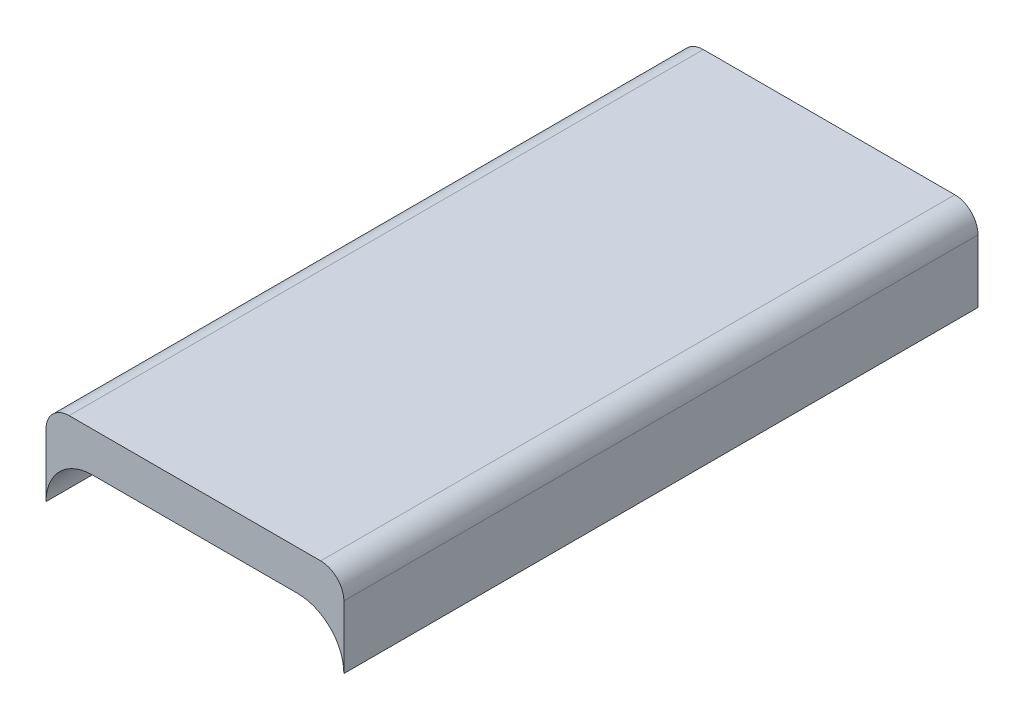
ISO-10303-21;
HEADER;
FILE_DESCRIPTION(('STEP AP214'),'2;1');
FILE_NAME('part.step','',(''),(''),'','','');
FILE_SCHEMA(('AUTOMOTIVE_DESIGN { 1 0 10303 214 1 1 1 1 }'));
ENDSEC;
DATA;
#1=APPLICATION_CONTEXT('core data for automotive mechanical design processes');
#2=APPLICATION_PROTOCOL_DEFINITION('international standard','automotive_design',2000,#1);
#3=PRODUCT_CONTEXT('',#1,'mechanical');
#4=PRODUCT('Part','Part','',(#3));
#5=PRODUCT_RELATED_PRODUCT_CATEGORY('part','',(#4));
#6=PRODUCT_DEFINITION_FORMATION('','',#4);
#7=PRODUCT_DEFINITION_CONTEXT('part definition',#1,'design');
#8=PRODUCT_DEFINITION('design','',#6,#7);
#9=PRODUCT_DEFINITION_SHAPE('','',#8);
#10=(LENGTH_UNIT() NAMED_UNIT(*) SI_UNIT(.MILLI.,.METRE.));
#11=(NAMED_UNIT(*) PLANE_ANGLE_UNIT() SI_UNIT($,.RADIAN.));
#12=(NAMED_UNIT(*) SI_UNIT($,.STERADIAN.) SOLID_ANGLE_UNIT());
#13=UNCERTAINTY_MEASURE_WITH_UNIT(LENGTH_MEASURE(1.E-05),#10,'distance_accuracy_value','');
#14=(GEOMETRIC_REPRESENTATION_CONTEXT(3) GLOBAL_UNCERTAINTY_ASSIGNED_CONTEXT((#13)) GLOBAL_UNIT_ASSIGNED_CONTEXT((#10,
#11,#12)) REPRESENTATION_CONTEXT('',''));
#15=CARTESIAN_POINT('',(0.,0.,0.));
#16=DIRECTION('',(0.,0.,1.));
#17=DIRECTION('',(1.,0.,0.));
#18=AXIS2_PLACEMENT_3D('',#15,#16,#17);
#19=CARTESIAN_POINT('',(-22.5,13.,-47.9));
#20=DIRECTION('',(1.,0.,0.));
#21=DIRECTION('',(0.,0.,-1.));
#22=AXIS2_PLACEMENT_3D('',#19,#20,#21);
#23=PLANE('',#22);
#24=DIRECTION('',(0.,-1.,0.));
#25=VECTOR('',#24,1.);
#26=CARTESIAN_POINT('',(-22.5,13.,47.9));
#27=LINE('',#26,#25);
#28=CARTESIAN_POINT('',(-22.5,9.5,47.9));
#29=VERTEX_POINT('',#28);
#30=CARTESIAN_POINT('',(-22.5,0.,47.9));
#31=VERTEX_POINT('',#30);
#32=EDGE_CURVE('E166',#29,#31,#27,.T.);
#33=ORIENTED_EDGE('',*,*,#32,.F.);
#34=DIRECTION('',(0.,0.,1.));
#35=VECTOR('',#34,1.);
#36=CARTESIAN_POINT('',(-22.5,9.5,-47.9));
#37=LINE('',#36,#35);
#38=CARTESIAN_POINT('',(-22.5,9.5,-47.9));
#39=VERTEX_POINT('',#38);
#40=EDGE_CURVE('E63',#29,#39,#37,.F.);
#41=ORIENTED_EDGE('',*,*,#40,.T.);
#42=DIRECTION('',(0.,-1.,0.));
#43=VECTOR('',#42,1.);
#44=CARTESIAN_POINT('',(-22.5,13.,-47.9));
#45=LINE('',#44,#43);
#46=CARTESIAN_POINT('',(-22.5,0.,-47.9));
#47=VERTEX_POINT('',#46);
#48=EDGE_CURVE('E103',#39,#47,#45,.T.);
#49=ORIENTED_EDGE('',*,*,#48,.T.);
#50=DIRECTION('',(0.,0.,1.));
#51=VECTOR('',#50,1.);
#52=CARTESIAN_POINT('',(-22.5,0.,-47.9));
#53=LINE('',#52,#51);
#54=EDGE_CURVE('E105',#47,#31,#53,.T.);
#55=ORIENTED_EDGE('',*,*,#54,.T.);
#56=EDGE_LOOP('',(#33,#41,#49,#55));
#57=FACE_BOUND('',#56,.T.);
#58=ADVANCED_FACE('F39',(#57),#23,.F.);
#59=CARTESIAN_POINT('',(-22.5,13.,47.9));
#60=DIRECTION('',(0.,0.,-1.));
#61=DIRECTION('',(-1.,0.,0.));
#62=AXIS2_PLACEMENT_3D('',#59,#60,#61);
#63=PLANE('',#62);
#64=DIRECTION('',(1.,0.,0.));
#65=VECTOR('',#64,1.);
#66=CARTESIAN_POINT('',(-22.5,13.,47.9));
#67=LINE('',#66,#65);
#68=CARTESIAN_POINT('',(-19.,13.,47.9));
#69=VERTEX_POINT('',#68);
#70=CARTESIAN_POINT('',(19.,13.,47.9));
#71=VERTEX_POINT('',#70);
#72=EDGE_CURVE('E151',#69,#71,#67,.T.);
#73=ORIENTED_EDGE('',*,*,#72,.F.);
#74=CARTESIAN_POINT('',(-19.,9.5,47.9));
#75=DIRECTION('',(0.,0.,-1.));
#76=DIRECTION('',(-1.,0.,0.));
#77=AXIS2_PLACEMENT_3D('',#74,#75,#76);
#78=CIRCLE('',#77,3.5);
#79=EDGE_CURVE('E180',#69,#29,#78,.F.);
#80=ORIENTED_EDGE('',*,*,#79,.T.);
#81=ORIENTED_EDGE('',*,*,#32,.T.);
#82=CARTESIAN_POINT('',(-15.5,0.,47.9));
#83=DIRECTION('',(0.,0.,1.));
#84=DIRECTION('',(1.,0.,0.));
#85=AXIS2_PLACEMENT_3D('',#82,#83,#84);
#86=CIRCLE('',#85,7.);
#87=CARTESIAN_POINT('',(-15.5,7.,47.9));
#88=VERTEX_POINT('',#87);
#89=EDGE_CURVE('E119',#88,#31,#86,.T.);
#90=ORIENTED_EDGE('',*,*,#89,.F.);
#91=DIRECTION('',(-1.,0.,0.));
#92=VECTOR('',#91,1.);
#93=CARTESIAN_POINT('',(-15.5,7.,47.9));
#94=LINE('',#93,#92);
#95=CARTESIAN_POINT('',(15.5,7.,47.9));
#96=VERTEX_POINT('',#95);
#97=EDGE_CURVE('E130',#96,#88,#94,.T.);
#98=ORIENTED_EDGE('',*,*,#97,.F.);
#99=CARTESIAN_POINT('',(15.5,0.,47.9));
#100=DIRECTION('',(0.,0.,1.));
#101=DIRECTION('',(-1.,0.,0.));
#102=AXIS2_PLACEMENT_3D('',#99,#100,#101);
#103=CIRCLE('',#102,7.);
#104=CARTESIAN_POINT('',(22.5,0.,47.9));
#105=VERTEX_POINT('',#104);
#106=EDGE_CURVE('E136',#105,#96,#103,.T.);
#107=ORIENTED_EDGE('',*,*,#106,.F.);
#108=DIRECTION('',(0.,-1.,0.));
#109=VECTOR('',#108,1.);
#110=CARTESIAN_POINT('',(22.5,13.,47.9));
#111=LINE('',#110,#109);
#112=CARTESIAN_POINT('',(22.5,9.5,47.9));
#113=VERTEX_POINT('',#112);
#114=EDGE_CURVE('E163',#113,#105,#111,.T.);
#115=ORIENTED_EDGE('',*,*,#114,.F.);
#116=CARTESIAN_POINT('',(19.,9.5,47.9));
#117=DIRECTION('',(0.,0.,-1.));
#118=DIRECTION('',(-1.,0.,0.));
#119=AXIS2_PLACEMENT_3D('',#116,#117,#118);
#120=CIRCLE('',#119,3.5);
#121=EDGE_CURVE('E177',#113,#71,#120,.F.);
#122=ORIENTED_EDGE('',*,*,#121,.T.);
#123=EDGE_LOOP('',(#73,#80,#81,#90,#98,#107,#115,#122));
#124=FACE_BOUND('',#123,.T.);
#125=ADVANCED_FACE('F195',(#124),#63,.F.);
#126=CARTESIAN_POINT('',(22.5,13.,-47.9));
#127=DIRECTION('',(-1.,0.,0.));
#128=DIRECTION('',(0.,0.,1.));
#129=AXIS2_PLACEMENT_3D('',#126,#127,#128);
#130=PLANE('',#129);
#131=DIRECTION('',(0.,-1.,0.));
#132=VECTOR('',#131,1.);
#133=CARTESIAN_POINT('',(22.5,13.,-47.9));
#134=LINE('',#133,#132);
#135=CARTESIAN_POINT('',(22.5,9.5,-47.9));
#136=VERTEX_POINT('',#135);
#137=CARTESIAN_POINT('',(22.5,0.,-47.9));
#138=VERTEX_POINT('',#137);
#139=EDGE_CURVE('E109',#136,#138,#134,.T.);
#140=ORIENTED_EDGE('',*,*,#139,.F.);
#141=DIRECTION('',(0.,0.,-1.));
#142=VECTOR('',#141,1.);
#143=CARTESIAN_POINT('',(22.5,9.5,47.9));
#144=LINE('',#143,#142);
#145=EDGE_CURVE('E11',#136,#113,#144,.F.);
#146=ORIENTED_EDGE('',*,*,#145,.T.);
#147=ORIENTED_EDGE('',*,*,#114,.T.);
#148=DIRECTION('',(0.,0.,-1.));
#149=VECTOR('',#148,1.);
#150=CARTESIAN_POINT('',(22.5,0.,-47.9));
#151=LINE('',#150,#149);
#152=EDGE_CURVE('E121',#105,#138,#151,.T.);
#153=ORIENTED_EDGE('',*,*,#152,.T.);
#154=EDGE_LOOP('',(#140,#146,#147,#153));
#155=FACE_BOUND('',#154,.T.);
#156=ADVANCED_FACE('F201',(#155),#130,.F.);
#157=CARTESIAN_POINT('',(-22.5,13.,-47.9));
#158=DIRECTION('',(0.,0.,1.));
#159=DIRECTION('',(1.,0.,0.));
#160=AXIS2_PLACEMENT_3D('',#157,#158,#159);
#161=PLANE('',#160);
#162=ORIENTED_EDGE('',*,*,#48,.F.);
#163=CARTESIAN_POINT('',(-19.,9.5,-47.9));
#164=DIRECTION('',(0.,0.,1.));
#165=DIRECTION('',(1.,0.,0.));
#166=AXIS2_PLACEMENT_3D('',#163,#164,#165);
#167=CIRCLE('',#166,3.5);
#168=CARTESIAN_POINT('',(-19.,13.,-47.9));
#169=VERTEX_POINT('',#168);
#170=EDGE_CURVE('E48',#39,#169,#167,.F.);
#171=ORIENTED_EDGE('',*,*,#170,.T.);
#172=DIRECTION('',(-1.,0.,0.));
#173=VECTOR('',#172,1.);
#174=CARTESIAN_POINT('',(-22.5,13.,-47.9));
#175=LINE('',#174,#173);
#176=CARTESIAN_POINT('',(19.,13.,-47.9));
#177=VERTEX_POINT('',#176);
#178=EDGE_CURVE('E110',#177,#169,#175,.T.);
#179=ORIENTED_EDGE('',*,*,#178,.F.);
#180=CARTESIAN_POINT('',(19.,9.5,-47.9));
#181=DIRECTION('',(0.,0.,1.));
#182=DIRECTION('',(1.,0.,0.));
#183=AXIS2_PLACEMENT_3D('',#180,#181,#182);
#184=CIRCLE('',#183,3.5);
#185=EDGE_CURVE('E55',#177,#136,#184,.F.);
#186=ORIENTED_EDGE('',*,*,#185,.T.);
#187=ORIENTED_EDGE('',*,*,#139,.T.);
#188=CARTESIAN_POINT('',(15.5,0.,-47.9));
#189=DIRECTION('',(0.,0.,1.));
#190=DIRECTION('',(-1.,0.,0.));
#191=AXIS2_PLACEMENT_3D('',#188,#189,#190);
#192=CIRCLE('',#191,7.);
#193=CARTESIAN_POINT('',(15.5,7.,-47.9));
#194=VERTEX_POINT('',#193);
#195=EDGE_CURVE('E129',#138,#194,#192,.T.);
#196=ORIENTED_EDGE('',*,*,#195,.T.);
#197=DIRECTION('',(-1.,0.,0.));
#198=VECTOR('',#197,1.);
#199=CARTESIAN_POINT('',(-15.5,7.,-47.9));
#200=LINE('',#199,#198);
#201=CARTESIAN_POINT('',(-15.5,7.,-47.9));
#202=VERTEX_POINT('',#201);
#203=EDGE_CURVE('E127',#194,#202,#200,.T.);
#204=ORIENTED_EDGE('',*,*,#203,.T.);
#205=CARTESIAN_POINT('',(-15.5,0.,-47.9));
#206=DIRECTION('',(0.,0.,1.));
#207=DIRECTION('',(1.,0.,0.));
#208=AXIS2_PLACEMENT_3D('',#205,#206,#207);
#209=CIRCLE('',#208,7.);
#210=EDGE_CURVE('E116',#202,#47,#209,.T.);
#211=ORIENTED_EDGE('',*,*,#210,.T.);
#212=EDGE_LOOP('',(#162,#171,#179,#186,#187,#196,#204,#211));
#213=FACE_BOUND('',#212,.T.);
#214=ADVANCED_FACE('F124',(#213),#161,.F.);
#215=CARTESIAN_POINT('',(0.,13.,0.));
#216=DIRECTION('',(0.,1.,0.));
#217=DIRECTION('',(0.,0.,1.));
#218=AXIS2_PLACEMENT_3D('',#215,#216,#217);
#219=PLANE('',#218);
#220=ORIENTED_EDGE('',*,*,#178,.T.);
#221=DIRECTION('',(0.,0.,1.));
#222=VECTOR('',#221,1.);
#223=CARTESIAN_POINT('',(-19.,13.,47.9));
#224=LINE('',#223,#222);
#225=EDGE_CURVE('E173',#169,#69,#224,.T.);
#226=ORIENTED_EDGE('',*,*,#225,.T.);
#227=ORIENTED_EDGE('',*,*,#72,.T.);
#228=DIRECTION('',(0.,0.,-1.));
#229=VECTOR('',#228,1.);
#230=CARTESIAN_POINT('',(19.,13.,-47.9));
#231=LINE('',#230,#229);
#232=EDGE_CURVE('E169',#71,#177,#231,.T.);
#233=ORIENTED_EDGE('',*,*,#232,.T.);
#234=EDGE_LOOP('',(#220,#226,#227,#233));
#235=FACE_BOUND('',#234,.T.);
#236=ADVANCED_FACE('F190',(#235),#219,.T.);
#237=CARTESIAN_POINT('',(-15.5,0.,-47.9));
#238=DIRECTION('',(0.,0.,1.));
#239=DIRECTION('',(1.,0.,0.));
#240=AXIS2_PLACEMENT_3D('',#237,#238,#239);
#241=CYLINDRICAL_SURFACE('',#240,7.);
#242=ORIENTED_EDGE('',*,*,#89,.T.);
#243=ORIENTED_EDGE('',*,*,#54,.F.);
#244=ORIENTED_EDGE('',*,*,#210,.F.);
#245=DIRECTION('',(0.,0.,1.));
#246=VECTOR('',#245,1.);
#247=CARTESIAN_POINT('',(-15.5,7.,-47.9));
#248=LINE('',#247,#246);
#249=EDGE_CURVE('E122',#202,#88,#248,.T.);
#250=ORIENTED_EDGE('',*,*,#249,.T.);
#251=EDGE_LOOP('',(#242,#243,#244,#250));
#252=FACE_BOUND('',#251,.T.);
#253=ADVANCED_FACE('F115',(#252),#241,.F.);
#254=CARTESIAN_POINT('',(-15.5,7.,-47.9));
#255=DIRECTION('',(0.,1.,0.));
#256=DIRECTION('',(-1.,0.,0.));
#257=AXIS2_PLACEMENT_3D('',#254,#255,#256);
#258=PLANE('',#257);
#259=ORIENTED_EDGE('',*,*,#97,.T.);
#260=ORIENTED_EDGE('',*,*,#249,.F.);
#261=ORIENTED_EDGE('',*,*,#203,.F.);
#262=DIRECTION('',(0.,0.,1.));
#263=VECTOR('',#262,1.);
#264=CARTESIAN_POINT('',(15.5,7.,-47.9));
#265=LINE('',#264,#263);
#266=EDGE_CURVE('E141',#194,#96,#265,.T.);
#267=ORIENTED_EDGE('',*,*,#266,.T.);
#268=EDGE_LOOP('',(#259,#260,#261,#267));
#269=FACE_BOUND('',#268,.T.);
#270=ADVANCED_FACE('F209',(#269),#258,.F.);
#271=CARTESIAN_POINT('',(15.5,0.,-47.9));
#272=DIRECTION('',(0.,0.,1.));
#273=DIRECTION('',(1.,0.,0.));
#274=AXIS2_PLACEMENT_3D('',#271,#272,#273);
#275=CYLINDRICAL_SURFACE('',#274,7.);
#276=ORIENTED_EDGE('',*,*,#106,.T.);
#277=ORIENTED_EDGE('',*,*,#266,.F.);
#278=ORIENTED_EDGE('',*,*,#195,.F.);
#279=ORIENTED_EDGE('',*,*,#152,.F.);
#280=EDGE_LOOP('',(#276,#277,#278,#279));
#281=FACE_BOUND('',#280,.T.);
#282=ADVANCED_FACE('F206',(#281),#275,.F.);
#283=CARTESIAN_POINT('',(-19.,9.5,0.));
#284=DIRECTION('',(0.,0.,-1.));
#285=DIRECTION('',(-1.,0.,0.));
#286=AXIS2_PLACEMENT_3D('',#283,#284,#285);
#287=CYLINDRICAL_SURFACE('',#286,3.5);
#288=ORIENTED_EDGE('',*,*,#170,.F.);
#289=ORIENTED_EDGE('',*,*,#40,.F.);
#290=ORIENTED_EDGE('',*,*,#79,.F.);
#291=ORIENTED_EDGE('',*,*,#225,.F.);
#292=EDGE_LOOP('',(#288,#289,#290,#291));
#293=FACE_BOUND('',#292,.T.);
#294=ADVANCED_FACE('F193',(#293),#287,.T.);
#295=CARTESIAN_POINT('',(19.,9.5,0.));
#296=DIRECTION('',(0.,0.,1.));
#297=DIRECTION('',(1.,0.,0.));
#298=AXIS2_PLACEMENT_3D('',#295,#296,#297);
#299=CYLINDRICAL_SURFACE('',#298,3.5);
#300=ORIENTED_EDGE('',*,*,#121,.F.);
#301=ORIENTED_EDGE('',*,*,#145,.F.);
#302=ORIENTED_EDGE('',*,*,#185,.F.);
#303=ORIENTED_EDGE('',*,*,#232,.F.);
#304=EDGE_LOOP('',(#300,#301,#302,#303));
#305=FACE_BOUND('',#304,.T.);
#306=ADVANCED_FACE('F41',(#305),#299,.T.);
#307=CLOSED_SHELL('',(#58,#125,#156,#214,#236,#253,#270,#282,#294,#306));
#308=MANIFOLD_SOLID_BREP('B2',#307);
#309=ADVANCED_BREP_SHAPE_REPRESENTATION('',(#18,#308),#14);
#310=SHAPE_DEFINITION_REPRESENTATION(#9,#309);
ENDSEC;
END-ISO-10303-21;
